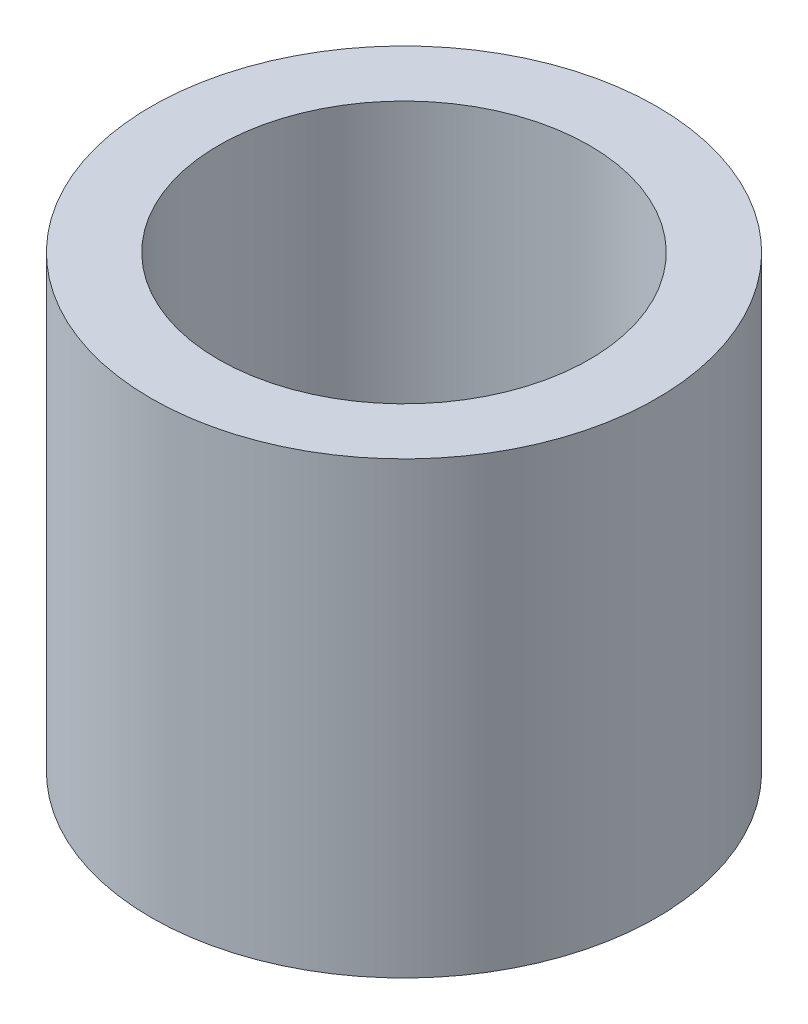
ISO-10303-21;
HEADER;
FILE_DESCRIPTION(('STEP AP214'),'2;1');
FILE_NAME('part.step','',(''),(''),'','','');
FILE_SCHEMA(('AUTOMOTIVE_DESIGN { 1 0 10303 214 1 1 1 1 }'));
ENDSEC;
DATA;
#1=APPLICATION_CONTEXT('core data for automotive mechanical design processes');
#2=APPLICATION_PROTOCOL_DEFINITION('international standard','automotive_design',2000,#1);
#3=PRODUCT_CONTEXT('',#1,'mechanical');
#4=PRODUCT('Part','Part','',(#3));
#5=PRODUCT_RELATED_PRODUCT_CATEGORY('part','',(#4));
#6=PRODUCT_DEFINITION_FORMATION('','',#4);
#7=PRODUCT_DEFINITION_CONTEXT('part definition',#1,'design');
#8=PRODUCT_DEFINITION('design','',#6,#7);
#9=PRODUCT_DEFINITION_SHAPE('','',#8);
#10=(LENGTH_UNIT() NAMED_UNIT(*) SI_UNIT(.MILLI.,.METRE.));
#11=(NAMED_UNIT(*) PLANE_ANGLE_UNIT() SI_UNIT($,.RADIAN.));
#12=(NAMED_UNIT(*) SI_UNIT($,.STERADIAN.) SOLID_ANGLE_UNIT());
#13=UNCERTAINTY_MEASURE_WITH_UNIT(LENGTH_MEASURE(1.E-05),#10,'distance_accuracy_value','');
#14=(GEOMETRIC_REPRESENTATION_CONTEXT(3) GLOBAL_UNCERTAINTY_ASSIGNED_CONTEXT((#13)) GLOBAL_UNIT_ASSIGNED_CONTEXT((#10,
#11,#12)) REPRESENTATION_CONTEXT('',''));
#15=CARTESIAN_POINT('',(0.,0.,0.));
#16=DIRECTION('',(0.,0.,1.));
#17=DIRECTION('',(1.,0.,0.));
#18=AXIS2_PLACEMENT_3D('',#15,#16,#17);
#19=CARTESIAN_POINT('',(0.,5.08,0.));
#20=DIRECTION('',(0.,1.,0.));
#21=DIRECTION('',(0.,0.,1.));
#22=AXIS2_PLACEMENT_3D('',#19,#20,#21);
#23=PLANE('',#22);
#24=CARTESIAN_POINT('',(0.,5.08,0.));
#25=DIRECTION('',(0.,1.,0.));
#26=DIRECTION('',(0.,0.,1.));
#27=AXIS2_PLACEMENT_3D('',#24,#25,#26);
#28=CIRCLE('',#27,5.715);
#29=CARTESIAN_POINT('',(0.,5.08,5.715));
#30=VERTEX_POINT('',#29);
#31=EDGE_CURVE('E10',#30,#30,#28,.T.);
#32=ORIENTED_EDGE('',*,*,#31,.T.);
#33=EDGE_LOOP('',(#32));
#34=FACE_BOUND('',#33,.T.);
#35=CARTESIAN_POINT('',(0.,5.08,0.));
#36=DIRECTION('',(0.,1.,0.));
#37=DIRECTION('',(0.,0.,1.));
#38=AXIS2_PLACEMENT_3D('',#35,#36,#37);
#39=CIRCLE('',#38,4.191);
#40=CARTESIAN_POINT('',(0.,5.08,4.191));
#41=VERTEX_POINT('',#40);
#42=EDGE_CURVE('E45',#41,#41,#39,.T.);
#43=ORIENTED_EDGE('',*,*,#42,.F.);
#44=EDGE_LOOP('',(#43));
#45=FACE_BOUND('',#44,.T.);
#46=ADVANCED_FACE('F34',(#34,#45),#23,.T.);
#47=CARTESIAN_POINT('',(0.,-5.08,0.));
#48=DIRECTION('',(0.,1.,0.));
#49=DIRECTION('',(0.,0.,1.));
#50=AXIS2_PLACEMENT_3D('',#47,#48,#49);
#51=PLANE('',#50);
#52=CARTESIAN_POINT('',(0.,-5.08,0.));
#53=DIRECTION('',(0.,1.,0.));
#54=DIRECTION('',(0.,0.,1.));
#55=AXIS2_PLACEMENT_3D('',#52,#53,#54);
#56=CIRCLE('',#55,5.715);
#57=CARTESIAN_POINT('',(0.,-5.08,5.715));
#58=VERTEX_POINT('',#57);
#59=EDGE_CURVE('E38',#58,#58,#56,.T.);
#60=ORIENTED_EDGE('',*,*,#59,.F.);
#61=EDGE_LOOP('',(#60));
#62=FACE_BOUND('',#61,.T.);
#63=CARTESIAN_POINT('',(0.,-5.08,0.));
#64=DIRECTION('',(0.,1.,0.));
#65=DIRECTION('',(0.,0.,1.));
#66=AXIS2_PLACEMENT_3D('',#63,#64,#65);
#67=CIRCLE('',#66,4.191);
#68=CARTESIAN_POINT('',(0.,-5.08,4.191));
#69=VERTEX_POINT('',#68);
#70=EDGE_CURVE('E47',#69,#69,#67,.T.);
#71=ORIENTED_EDGE('',*,*,#70,.T.);
#72=EDGE_LOOP('',(#71));
#73=FACE_BOUND('',#72,.T.);
#74=ADVANCED_FACE('F57',(#62,#73),#51,.F.);
#75=CARTESIAN_POINT('',(0.,5.08,0.));
#76=DIRECTION('',(0.,-1.,0.));
#77=DIRECTION('',(0.,0.,-1.));
#78=AXIS2_PLACEMENT_3D('',#75,#76,#77);
#79=CYLINDRICAL_SURFACE('',#78,5.715);
#80=ORIENTED_EDGE('',*,*,#31,.F.);
#81=EDGE_LOOP('',(#80));
#82=FACE_BOUND('',#81,.T.);
#83=ORIENTED_EDGE('',*,*,#59,.T.);
#84=EDGE_LOOP('',(#83));
#85=FACE_BOUND('',#84,.T.);
#86=ADVANCED_FACE('F36',(#82,#85),#79,.T.);
#87=CARTESIAN_POINT('',(0.,5.08,0.));
#88=DIRECTION('',(0.,-1.,0.));
#89=DIRECTION('',(0.,0.,-1.));
#90=AXIS2_PLACEMENT_3D('',#87,#88,#89);
#91=CYLINDRICAL_SURFACE('',#90,4.191);
#92=ORIENTED_EDGE('',*,*,#42,.T.);
#93=EDGE_LOOP('',(#92));
#94=FACE_BOUND('',#93,.T.);
#95=ORIENTED_EDGE('',*,*,#70,.F.);
#96=EDGE_LOOP('',(#95));
#97=FACE_BOUND('',#96,.T.);
#98=ADVANCED_FACE('F53',(#94,#97),#91,.F.);
#99=CLOSED_SHELL('',(#46,#74,#86,#98));
#100=MANIFOLD_SOLID_BREP('B2',#99);
#101=ADVANCED_BREP_SHAPE_REPRESENTATION('',(#18,#100),#14);
#102=SHAPE_DEFINITION_REPRESENTATION(#9,#101);
ENDSEC;
END-ISO-10303-21;
